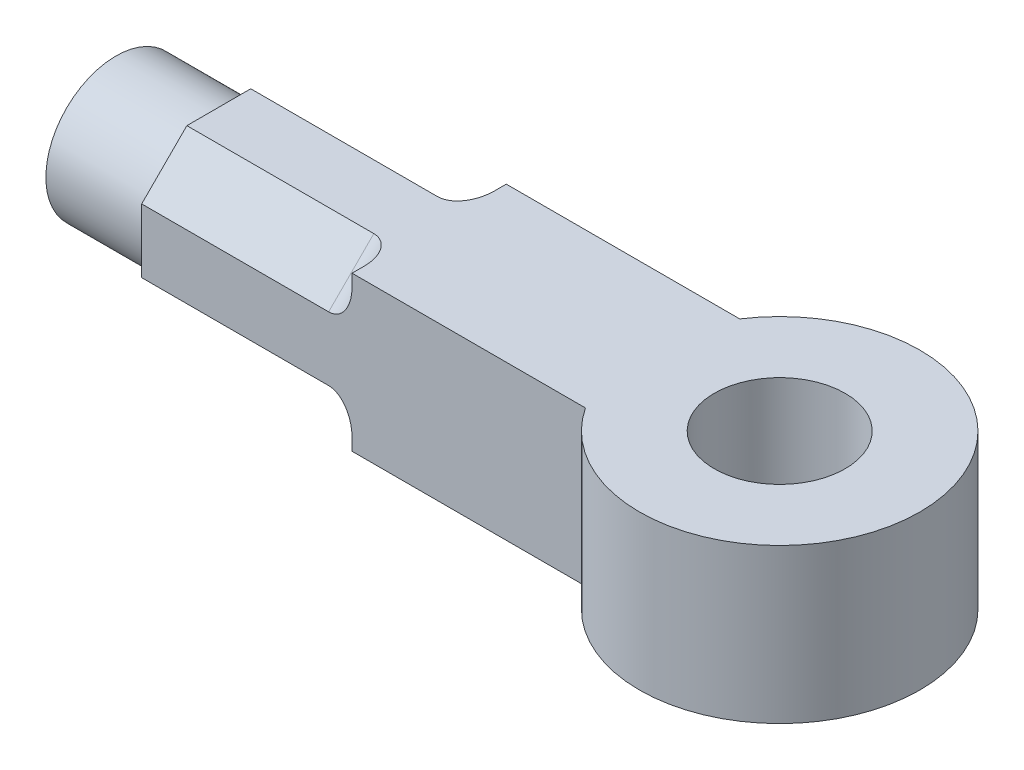
ISO-10303-21;
HEADER;
FILE_DESCRIPTION(('STEP AP214'),'2;1');
FILE_NAME('part.step','',(''),(''),'','','');
FILE_SCHEMA(('AUTOMOTIVE_DESIGN { 1 0 10303 214 1 1 1 1 }'));
ENDSEC;
DATA;
#1=APPLICATION_CONTEXT('core data for automotive mechanical design processes');
#2=APPLICATION_PROTOCOL_DEFINITION('international standard','automotive_design',2000,#1);
#3=PRODUCT_CONTEXT('',#1,'mechanical');
#4=PRODUCT('Part','Part','',(#3));
#5=PRODUCT_RELATED_PRODUCT_CATEGORY('part','',(#4));
#6=PRODUCT_DEFINITION_FORMATION('','',#4);
#7=PRODUCT_DEFINITION_CONTEXT('part definition',#1,'design');
#8=PRODUCT_DEFINITION('design','',#6,#7);
#9=PRODUCT_DEFINITION_SHAPE('','',#8);
#10=(LENGTH_UNIT() NAMED_UNIT(*) SI_UNIT(.MILLI.,.METRE.));
#11=(NAMED_UNIT(*) PLANE_ANGLE_UNIT() SI_UNIT($,.RADIAN.));
#12=(NAMED_UNIT(*) SI_UNIT($,.STERADIAN.) SOLID_ANGLE_UNIT());
#13=UNCERTAINTY_MEASURE_WITH_UNIT(LENGTH_MEASURE(1.E-05),#10,'distance_accuracy_value','');
#14=(GEOMETRIC_REPRESENTATION_CONTEXT(3) GLOBAL_UNCERTAINTY_ASSIGNED_CONTEXT((#13)) GLOBAL_UNIT_ASSIGNED_CONTEXT((#10,
#11,#12)) REPRESENTATION_CONTEXT('',''));
#15=CARTESIAN_POINT('',(0.,0.,0.));
#16=DIRECTION('',(0.,0.,1.));
#17=DIRECTION('',(1.,0.,0.));
#18=AXIS2_PLACEMENT_3D('',#15,#16,#17);
#19=CARTESIAN_POINT('',(-49.1176439316651,0.,0.));
#20=DIRECTION('',(-1.,0.,0.));
#21=DIRECTION('',(0.,0.,1.));
#22=AXIS2_PLACEMENT_3D('',#19,#20,#21);
#23=PLANE('',#22);
#24=DIRECTION('',(0.,0.,1.));
#25=VECTOR('',#24,1.);
#26=CARTESIAN_POINT('',(-49.1176439316651,1.65,-1.65));
#27=LINE('',#26,#25);
#28=CARTESIAN_POINT('',(-49.1176439316651,1.65,1.39055915910216));
#29=VERTEX_POINT('',#28);
#30=CARTESIAN_POINT('',(-49.1176439316651,1.65,1.65));
#31=VERTEX_POINT('',#30);
#32=EDGE_CURVE('E252',#29,#31,#27,.T.);
#33=ORIENTED_EDGE('',*,*,#32,.F.);
#34=DIRECTION('',(0.,-0.707106781186548,0.707106781186547));
#35=VECTOR('',#34,1.);
#36=CARTESIAN_POINT('',(-49.1176439316651,1.52027957955108,1.52027957955108));
#37=LINE('',#36,#35);
#38=CARTESIAN_POINT('',(-49.1176439316651,1.39055915910216,1.65));
#39=VERTEX_POINT('',#38);
#40=EDGE_CURVE('E202',#29,#39,#37,.T.);
#41=ORIENTED_EDGE('',*,*,#40,.T.);
#42=DIRECTION('',(0.,-1.,0.));
#43=VECTOR('',#42,1.);
#44=CARTESIAN_POINT('',(-49.1176439316651,1.65,1.65));
#45=LINE('',#44,#43);
#46=EDGE_CURVE('E192',#31,#39,#45,.T.);
#47=ORIENTED_EDGE('',*,*,#46,.F.);
#48=EDGE_LOOP('',(#33,#41,#47));
#49=FACE_BOUND('',#48,.T.);
#50=ADVANCED_FACE('F38',(#49),#23,.T.);
#51=CARTESIAN_POINT('',(-49.1176439316651,-1.39055915910215,1.65));
#52=VERTEX_POINT('',#51);
#53=CARTESIAN_POINT('',(-49.1176439316651,-1.65,1.65));
#54=VERTEX_POINT('',#53);
#55=EDGE_CURVE('E156',#52,#54,#45,.T.);
#56=ORIENTED_EDGE('',*,*,#55,.F.);
#57=DIRECTION('',(0.,-0.707106781186548,-0.707106781186548));
#58=VECTOR('',#57,1.);
#59=CARTESIAN_POINT('',(-49.1176439316651,-1.52027957955108,1.52027957955108));
#60=LINE('',#59,#58);
#61=CARTESIAN_POINT('',(-49.1176439316651,-1.65,1.39055915910215));
#62=VERTEX_POINT('',#61);
#63=EDGE_CURVE('E187',#52,#62,#60,.T.);
#64=ORIENTED_EDGE('',*,*,#63,.T.);
#65=DIRECTION('',(0.,0.,-1.));
#66=VECTOR('',#65,1.);
#67=CARTESIAN_POINT('',(-49.1176439316651,-1.65,-1.65));
#68=LINE('',#67,#66);
#69=EDGE_CURVE('E238',#54,#62,#68,.T.);
#70=ORIENTED_EDGE('',*,*,#69,.F.);
#71=EDGE_LOOP('',(#56,#64,#70));
#72=FACE_BOUND('',#71,.T.);
#73=ADVANCED_FACE('F355',(#72),#23,.T.);
#74=CARTESIAN_POINT('',(-49.1176439316651,-1.65,-1.39055915910215));
#75=VERTEX_POINT('',#74);
#76=CARTESIAN_POINT('',(-49.1176439316651,-1.65,-1.65));
#77=VERTEX_POINT('',#76);
#78=EDGE_CURVE('E240',#75,#77,#68,.T.);
#79=ORIENTED_EDGE('',*,*,#78,.F.);
#80=DIRECTION('',(0.,0.707106781186547,-0.707106781186548));
#81=VECTOR('',#80,1.);
#82=CARTESIAN_POINT('',(-49.1176439316651,-1.52027957955108,-1.52027957955108));
#83=LINE('',#82,#81);
#84=CARTESIAN_POINT('',(-49.1176439316651,-1.39055915910215,-1.65));
#85=VERTEX_POINT('',#84);
#86=EDGE_CURVE('E195',#75,#85,#83,.T.);
#87=ORIENTED_EDGE('',*,*,#86,.T.);
#88=DIRECTION('',(0.,1.,0.));
#89=VECTOR('',#88,1.);
#90=CARTESIAN_POINT('',(-49.1176439316651,1.65,-1.65));
#91=LINE('',#90,#89);
#92=EDGE_CURVE('E243',#77,#85,#91,.T.);
#93=ORIENTED_EDGE('',*,*,#92,.F.);
#94=EDGE_LOOP('',(#79,#87,#93));
#95=FACE_BOUND('',#94,.T.);
#96=ADVANCED_FACE('F362',(#95),#23,.T.);
#97=CARTESIAN_POINT('',(-49.1176439316651,1.39055915910216,-1.65));
#98=VERTEX_POINT('',#97);
#99=CARTESIAN_POINT('',(-49.1176439316651,1.65,-1.65));
#100=VERTEX_POINT('',#99);
#101=EDGE_CURVE('E246',#98,#100,#91,.T.);
#102=ORIENTED_EDGE('',*,*,#101,.F.);
#103=DIRECTION('',(0.,0.707106781186548,0.707106781186548));
#104=VECTOR('',#103,1.);
#105=CARTESIAN_POINT('',(-49.1176439316651,1.52027957955108,-1.52027957955108));
#106=LINE('',#105,#104);
#107=CARTESIAN_POINT('',(-49.1176439316651,1.65,-1.39055915910215));
#108=VERTEX_POINT('',#107);
#109=EDGE_CURVE('E209',#98,#108,#106,.T.);
#110=ORIENTED_EDGE('',*,*,#109,.T.);
#111=EDGE_CURVE('E250',#100,#108,#27,.T.);
#112=ORIENTED_EDGE('',*,*,#111,.F.);
#113=EDGE_LOOP('',(#102,#110,#112));
#114=FACE_BOUND('',#113,.T.);
#115=ADVANCED_FACE('F358',(#114),#23,.T.);
#116=CARTESIAN_POINT('',(-41.6176439316651,1.8,0.));
#117=DIRECTION('',(0.,-1.,0.));
#118=DIRECTION('',(0.,0.,-1.));
#119=AXIS2_PLACEMENT_3D('',#116,#117,#118);
#120=CYLINDRICAL_SURFACE('',#119,3.);
#121=DIRECTION('',(0.,-1.,0.));
#122=VECTOR('',#121,1.);
#123=CARTESIAN_POINT('',(-44.1231378949386,1.8,1.65));
#124=LINE('',#123,#122);
#125=CARTESIAN_POINT('',(-44.1231378949386,1.65,1.65));
#126=VERTEX_POINT('',#125);
#127=CARTESIAN_POINT('',(-44.1231378949354,-1.65,1.65));
#128=VERTEX_POINT('',#127);
#129=EDGE_CURVE('E154',#126,#128,#124,.T.);
#130=ORIENTED_EDGE('',*,*,#129,.T.);
#131=CARTESIAN_POINT('',(-41.6176439316651,-1.65,0.));
#132=DIRECTION('',(0.,1.,0.));
#133=DIRECTION('',(0.,0.,1.));
#134=AXIS2_PLACEMENT_3D('',#131,#132,#133);
#135=CIRCLE('',#134,3.);
#136=CARTESIAN_POINT('',(-44.1231378949386,-1.65,-1.65));
#137=VERTEX_POINT('',#136);
#138=EDGE_CURVE('E164',#128,#137,#135,.T.);
#139=ORIENTED_EDGE('',*,*,#138,.T.);
#140=DIRECTION('',(0.,-1.,0.));
#141=VECTOR('',#140,1.);
#142=CARTESIAN_POINT('',(-44.1231378949386,1.8,-1.65));
#143=LINE('',#142,#141);
#144=CARTESIAN_POINT('',(-44.1231378949354,1.65,-1.65));
#145=VERTEX_POINT('',#144);
#146=EDGE_CURVE('E178',#137,#145,#143,.F.);
#147=ORIENTED_EDGE('',*,*,#146,.T.);
#148=CARTESIAN_POINT('',(-41.6176439316651,1.65,0.));
#149=DIRECTION('',(0.,-1.,0.));
#150=DIRECTION('',(0.,0.,-1.));
#151=AXIS2_PLACEMENT_3D('',#148,#149,#150);
#152=CIRCLE('',#151,3.);
#153=EDGE_CURVE('E176',#145,#126,#152,.T.);
#154=ORIENTED_EDGE('',*,*,#153,.T.);
#155=EDGE_LOOP('',(#130,#139,#147,#154));
#156=FACE_BOUND('',#155,.T.);
#157=ADVANCED_FACE('F174',(#156),#120,.T.);
#158=CARTESIAN_POINT('',(-41.6176439316651,1.8,0.));
#159=DIRECTION('',(0.,-1.,0.));
#160=DIRECTION('',(0.,0.,-1.));
#161=AXIS2_PLACEMENT_3D('',#158,#159,#160);
#162=CYLINDRICAL_SURFACE('',#161,1.4);
#163=CARTESIAN_POINT('',(-41.6176439316651,-1.65,0.));
#164=DIRECTION('',(0.,1.,0.));
#165=DIRECTION('',(0.,0.,1.));
#166=AXIS2_PLACEMENT_3D('',#163,#164,#165);
#167=CIRCLE('',#166,1.4);
#168=CARTESIAN_POINT('',(-41.6176439316651,-1.65,1.4));
#169=VERTEX_POINT('',#168);
#170=EDGE_CURVE('E171',#169,#169,#167,.T.);
#171=ORIENTED_EDGE('',*,*,#170,.F.);
#172=EDGE_LOOP('',(#171));
#173=FACE_BOUND('',#172,.T.);
#174=CARTESIAN_POINT('',(-41.6176439316651,1.65,0.));
#175=DIRECTION('',(0.,-1.,0.));
#176=DIRECTION('',(0.,0.,-1.));
#177=AXIS2_PLACEMENT_3D('',#174,#175,#176);
#178=CIRCLE('',#177,1.4);
#179=CARTESIAN_POINT('',(-41.6176439316651,1.65,-1.4));
#180=VERTEX_POINT('',#179);
#181=EDGE_CURVE('E322',#180,#180,#178,.T.);
#182=ORIENTED_EDGE('',*,*,#181,.F.);
#183=EDGE_LOOP('',(#182));
#184=FACE_BOUND('',#183,.T.);
#185=ADVANCED_FACE('F335',(#173,#184),#162,.F.);
#186=CARTESIAN_POINT('',(49958.3823560683,-1.65,-1.65));
#187=DIRECTION('',(0.,1.,0.));
#188=DIRECTION('',(0.,0.,1.));
#189=AXIS2_PLACEMENT_3D('',#186,#187,#188);
#190=PLANE('',#189);
#191=ORIENTED_EDGE('',*,*,#78,.T.);
#192=DIRECTION('',(-1.,0.,0.));
#193=VECTOR('',#192,1.);
#194=CARTESIAN_POINT('',(49958.3823560683,-1.65,-1.65));
#195=LINE('',#194,#193);
#196=EDGE_CURVE('E161',#137,#77,#195,.T.);
#197=ORIENTED_EDGE('',*,*,#196,.F.);
#198=ORIENTED_EDGE('',*,*,#138,.F.);
#199=DIRECTION('',(-1.,0.,0.));
#200=VECTOR('',#199,1.);
#201=CARTESIAN_POINT('',(49958.3823560683,-1.65,1.65));
#202=LINE('',#201,#200);
#203=EDGE_CURVE('E150',#128,#54,#202,.T.);
#204=ORIENTED_EDGE('',*,*,#203,.T.);
#205=ORIENTED_EDGE('',*,*,#69,.T.);
#206=CARTESIAN_POINT('',(-49.6176439316651,-1.65,1.39055915910215));
#207=DIRECTION('',(0.,1.,0.));
#208=DIRECTION('',(0.,0.,-1.));
#209=AXIS2_PLACEMENT_3D('',#206,#207,#208);
#210=ELLIPSE('',#209,0.707106781186547,0.5);
#211=CARTESIAN_POINT('',(-49.6176439316651,-1.65,0.683452377915608));
#212=VERTEX_POINT('',#211);
#213=EDGE_CURVE('E215',#62,#212,#210,.T.);
#214=ORIENTED_EDGE('',*,*,#213,.T.);
#215=DIRECTION('',(-1.,0.,0.));
#216=VECTOR('',#215,1.);
#217=CARTESIAN_POINT('',(-49.1176439316651,-1.65,0.683452377915608));
#218=LINE('',#217,#216);
#219=CARTESIAN_POINT('',(-53.6176439316651,-1.65,0.683452377915608));
#220=VERTEX_POINT('',#219);
#221=EDGE_CURVE('E267',#212,#220,#218,.T.);
#222=ORIENTED_EDGE('',*,*,#221,.T.);
#223=DIRECTION('',(0.,0.,-1.));
#224=VECTOR('',#223,1.);
#225=CARTESIAN_POINT('',(-53.6176439316651,-1.65,0.683452377915608));
#226=LINE('',#225,#224);
#227=CARTESIAN_POINT('',(-53.6176439316651,-1.65,-0.683452377915607));
#228=VERTEX_POINT('',#227);
#229=EDGE_CURVE('E301',#220,#228,#226,.T.);
#230=ORIENTED_EDGE('',*,*,#229,.T.);
#231=DIRECTION('',(-1.,0.,0.));
#232=VECTOR('',#231,1.);
#233=CARTESIAN_POINT('',(-49.1176439316651,-1.65,-0.683452377915607));
#234=LINE('',#233,#232);
#235=CARTESIAN_POINT('',(-49.6176439316651,-1.65,-0.683452377915607));
#236=VERTEX_POINT('',#235);
#237=EDGE_CURVE('E270',#236,#228,#234,.T.);
#238=ORIENTED_EDGE('',*,*,#237,.F.);
#239=CARTESIAN_POINT('',(-49.6176439316651,-1.65,-1.39055915910215));
#240=DIRECTION('',(0.,1.,0.));
#241=DIRECTION('',(0.,0.,-1.));
#242=AXIS2_PLACEMENT_3D('',#239,#240,#241);
#243=ELLIPSE('',#242,0.707106781186548,0.5);
#244=EDGE_CURVE('E224',#236,#75,#243,.T.);
#245=ORIENTED_EDGE('',*,*,#244,.T.);
#246=EDGE_LOOP('',(#191,#197,#198,#204,#205,#214,#222,#230,#238,#245));
#247=FACE_BOUND('',#246,.T.);
#248=ORIENTED_EDGE('',*,*,#170,.T.);
#249=EDGE_LOOP('',(#248));
#250=FACE_BOUND('',#249,.T.);
#251=ADVANCED_FACE('F166',(#247,#250),#190,.F.);
#252=CARTESIAN_POINT('',(49958.3823560683,1.65,1.65));
#253=DIRECTION('',(0.,0.,-1.));
#254=DIRECTION('',(0.,1.,0.));
#255=AXIS2_PLACEMENT_3D('',#252,#253,#254);
#256=PLANE('',#255);
#257=ORIENTED_EDGE('',*,*,#203,.F.);
#258=ORIENTED_EDGE('',*,*,#129,.F.);
#259=DIRECTION('',(-1.,0.,0.));
#260=VECTOR('',#259,1.);
#261=CARTESIAN_POINT('',(49958.3823560683,1.65,1.65));
#262=LINE('',#261,#260);
#263=EDGE_CURVE('E184',#126,#31,#262,.T.);
#264=ORIENTED_EDGE('',*,*,#263,.T.);
#265=ORIENTED_EDGE('',*,*,#46,.T.);
#266=CARTESIAN_POINT('',(-49.6176439316651,1.39055915910216,1.65));
#267=DIRECTION('',(0.,0.,-1.));
#268=DIRECTION('',(0.,-1.,0.));
#269=AXIS2_PLACEMENT_3D('',#266,#267,#268);
#270=ELLIPSE('',#269,0.707106781186547,0.5);
#271=CARTESIAN_POINT('',(-49.6176439316651,0.683452377915608,1.65));
#272=VERTEX_POINT('',#271);
#273=EDGE_CURVE('E227',#39,#272,#270,.T.);
#274=ORIENTED_EDGE('',*,*,#273,.T.);
#275=DIRECTION('',(-1.,0.,0.));
#276=VECTOR('',#275,1.);
#277=CARTESIAN_POINT('',(-49.1176439316651,0.683452377915608,1.65));
#278=LINE('',#277,#276);
#279=CARTESIAN_POINT('',(-53.6176439316651,0.683452377915608,1.65));
#280=VERTEX_POINT('',#279);
#281=EDGE_CURVE('E181',#272,#280,#278,.T.);
#282=ORIENTED_EDGE('',*,*,#281,.T.);
#283=DIRECTION('',(0.,-1.,0.));
#284=VECTOR('',#283,1.);
#285=CARTESIAN_POINT('',(-53.6176439316651,0.683452377915608,1.65));
#286=LINE('',#285,#284);
#287=CARTESIAN_POINT('',(-53.6176439316651,-0.683452377915606,1.65));
#288=VERTEX_POINT('',#287);
#289=EDGE_CURVE('E309',#280,#288,#286,.T.);
#290=ORIENTED_EDGE('',*,*,#289,.T.);
#291=DIRECTION('',(-1.,0.,0.));
#292=VECTOR('',#291,1.);
#293=CARTESIAN_POINT('',(-49.1176439316651,-0.683452377915606,1.65));
#294=LINE('',#293,#292);
#295=CARTESIAN_POINT('',(-49.6176439316651,-0.683452377915606,1.65));
#296=VERTEX_POINT('',#295);
#297=EDGE_CURVE('E264',#296,#288,#294,.T.);
#298=ORIENTED_EDGE('',*,*,#297,.F.);
#299=CARTESIAN_POINT('',(-49.6176439316651,-1.39055915910215,1.65));
#300=DIRECTION('',(0.,0.,-1.));
#301=DIRECTION('',(0.,-1.,0.));
#302=AXIS2_PLACEMENT_3D('',#299,#300,#301);
#303=ELLIPSE('',#302,0.707106781186548,0.5);
#304=EDGE_CURVE('E218',#296,#52,#303,.T.);
#305=ORIENTED_EDGE('',*,*,#304,.T.);
#306=ORIENTED_EDGE('',*,*,#55,.T.);
#307=EDGE_LOOP('',(#257,#258,#264,#265,#274,#282,#290,#298,#305,#306));
#308=FACE_BOUND('',#307,.T.);
#309=ADVANCED_FACE('F152',(#308),#256,.F.);
#310=CARTESIAN_POINT('',(49958.3823560683,1.65,-1.65));
#311=DIRECTION('',(0.,0.,1.));
#312=DIRECTION('',(0.,-1.,0.));
#313=AXIS2_PLACEMENT_3D('',#310,#311,#312);
#314=PLANE('',#313);
#315=ORIENTED_EDGE('',*,*,#146,.F.);
#316=ORIENTED_EDGE('',*,*,#196,.T.);
#317=ORIENTED_EDGE('',*,*,#92,.T.);
#318=CARTESIAN_POINT('',(-49.6176439316651,-1.39055915910215,-1.65));
#319=DIRECTION('',(0.,0.,1.));
#320=DIRECTION('',(0.,1.,0.));
#321=AXIS2_PLACEMENT_3D('',#318,#319,#320);
#322=ELLIPSE('',#321,0.707106781186547,0.5);
#323=CARTESIAN_POINT('',(-49.6176439316651,-0.683452377915606,-1.65));
#324=VERTEX_POINT('',#323);
#325=EDGE_CURVE('E221',#85,#324,#322,.T.);
#326=ORIENTED_EDGE('',*,*,#325,.T.);
#327=DIRECTION('',(-1.,0.,0.));
#328=VECTOR('',#327,1.);
#329=CARTESIAN_POINT('',(-49.1176439316651,-0.683452377915606,-1.65));
#330=LINE('',#329,#328);
#331=CARTESIAN_POINT('',(-53.6176439316651,-0.683452377915606,-1.65));
#332=VERTEX_POINT('',#331);
#333=EDGE_CURVE('E273',#324,#332,#330,.T.);
#334=ORIENTED_EDGE('',*,*,#333,.T.);
#335=DIRECTION('',(0.,1.,0.));
#336=VECTOR('',#335,1.);
#337=CARTESIAN_POINT('',(-53.6176439316651,-0.683452377915606,-1.65));
#338=LINE('',#337,#336);
#339=CARTESIAN_POINT('',(-53.6176439316651,0.683452377915607,-1.65));
#340=VERTEX_POINT('',#339);
#341=EDGE_CURVE('E293',#332,#340,#338,.T.);
#342=ORIENTED_EDGE('',*,*,#341,.T.);
#343=DIRECTION('',(-1.,0.,0.));
#344=VECTOR('',#343,1.);
#345=CARTESIAN_POINT('',(-49.1176439316651,0.683452377915607,-1.65));
#346=LINE('',#345,#344);
#347=CARTESIAN_POINT('',(-49.6176439316651,0.683452377915607,-1.65));
#348=VERTEX_POINT('',#347);
#349=EDGE_CURVE('E276',#348,#340,#346,.T.);
#350=ORIENTED_EDGE('',*,*,#349,.F.);
#351=CARTESIAN_POINT('',(-49.6176439316651,1.39055915910216,-1.65));
#352=DIRECTION('',(0.,0.,1.));
#353=DIRECTION('',(0.,1.,0.));
#354=AXIS2_PLACEMENT_3D('',#351,#352,#353);
#355=ELLIPSE('',#354,0.707106781186548,0.5);
#356=EDGE_CURVE('E11',#348,#98,#355,.T.);
#357=ORIENTED_EDGE('',*,*,#356,.T.);
#358=ORIENTED_EDGE('',*,*,#101,.T.);
#359=DIRECTION('',(-1.,0.,0.));
#360=VECTOR('',#359,1.);
#361=CARTESIAN_POINT('',(49958.3823560683,1.65,-1.65));
#362=LINE('',#361,#360);
#363=EDGE_CURVE('E257',#145,#100,#362,.T.);
#364=ORIENTED_EDGE('',*,*,#363,.F.);
#365=EDGE_LOOP('',(#315,#316,#317,#326,#334,#342,#350,#357,#358,#364));
#366=FACE_BOUND('',#365,.T.);
#367=ADVANCED_FACE('F344',(#366),#314,.F.);
#368=CARTESIAN_POINT('',(49958.3823560683,1.65,-1.65));
#369=DIRECTION('',(0.,-1.,0.));
#370=DIRECTION('',(0.,0.,-1.));
#371=AXIS2_PLACEMENT_3D('',#368,#369,#370);
#372=PLANE('',#371);
#373=ORIENTED_EDGE('',*,*,#32,.T.);
#374=ORIENTED_EDGE('',*,*,#263,.F.);
#375=ORIENTED_EDGE('',*,*,#153,.F.);
#376=ORIENTED_EDGE('',*,*,#363,.T.);
#377=ORIENTED_EDGE('',*,*,#111,.T.);
#378=CARTESIAN_POINT('',(-49.6176439316651,1.65,-1.39055915910215));
#379=DIRECTION('',(0.,-1.,0.));
#380=DIRECTION('',(0.,0.,1.));
#381=AXIS2_PLACEMENT_3D('',#378,#379,#380);
#382=ELLIPSE('',#381,0.707106781186547,0.5);
#383=CARTESIAN_POINT('',(-49.6176439316651,1.65,-0.683452377915606));
#384=VERTEX_POINT('',#383);
#385=EDGE_CURVE('E47',#108,#384,#382,.T.);
#386=ORIENTED_EDGE('',*,*,#385,.T.);
#387=DIRECTION('',(-1.,0.,0.));
#388=VECTOR('',#387,1.);
#389=CARTESIAN_POINT('',(-49.1176439316651,1.65,-0.683452377915606));
#390=LINE('',#389,#388);
#391=CARTESIAN_POINT('',(-53.6176439316651,1.65,-0.683452377915606));
#392=VERTEX_POINT('',#391);
#393=EDGE_CURVE('E279',#384,#392,#390,.T.);
#394=ORIENTED_EDGE('',*,*,#393,.T.);
#395=DIRECTION('',(0.,0.,1.));
#396=VECTOR('',#395,1.);
#397=CARTESIAN_POINT('',(-53.6176439316651,1.65,-0.683452377915606));
#398=LINE('',#397,#396);
#399=CARTESIAN_POINT('',(-53.6176439316651,1.65,0.683452377915608));
#400=VERTEX_POINT('',#399);
#401=EDGE_CURVE('E285',#392,#400,#398,.T.);
#402=ORIENTED_EDGE('',*,*,#401,.T.);
#403=DIRECTION('',(-1.,0.,0.));
#404=VECTOR('',#403,1.);
#405=CARTESIAN_POINT('',(-49.1176439316651,1.65,0.683452377915608));
#406=LINE('',#405,#404);
#407=CARTESIAN_POINT('',(-49.6176439316651,1.65,0.683452377915608));
#408=VERTEX_POINT('',#407);
#409=EDGE_CURVE('E282',#408,#400,#406,.T.);
#410=ORIENTED_EDGE('',*,*,#409,.F.);
#411=CARTESIAN_POINT('',(-49.6176439316651,1.65,1.39055915910216));
#412=DIRECTION('',(0.,-1.,0.));
#413=DIRECTION('',(0.,0.,1.));
#414=AXIS2_PLACEMENT_3D('',#411,#412,#413);
#415=ELLIPSE('',#414,0.707106781186547,0.5);
#416=EDGE_CURVE('E230',#408,#29,#415,.T.);
#417=ORIENTED_EDGE('',*,*,#416,.T.);
#418=EDGE_LOOP('',(#373,#374,#375,#376,#377,#386,#394,#402,#410,#417));
#419=FACE_BOUND('',#418,.T.);
#420=ORIENTED_EDGE('',*,*,#181,.T.);
#421=EDGE_LOOP('',(#420));
#422=FACE_BOUND('',#421,.T.);
#423=ADVANCED_FACE('F341',(#419,#422),#372,.F.);
#424=CARTESIAN_POINT('',(-49.1176439316651,1.65,0.683452377915608));
#425=DIRECTION('',(0.,-0.707106781186547,-0.707106781186548));
#426=DIRECTION('',(0.,0.707106781186548,-0.707106781186547));
#427=AXIS2_PLACEMENT_3D('',#424,#425,#426);
#428=PLANE('',#427);
#429=ORIENTED_EDGE('',*,*,#281,.F.);
#430=DIRECTION('',(0.,-0.707106781186548,0.707106781186547));
#431=VECTOR('',#430,1.);
#432=CARTESIAN_POINT('',(-49.6176439316651,1.65,0.683452377915608));
#433=LINE('',#432,#431);
#434=EDGE_CURVE('E206',#272,#408,#433,.F.);
#435=ORIENTED_EDGE('',*,*,#434,.T.);
#436=ORIENTED_EDGE('',*,*,#409,.T.);
#437=DIRECTION('',(0.,-0.707106781186547,0.707106781186547));
#438=VECTOR('',#437,1.);
#439=CARTESIAN_POINT('',(-53.6176439316651,1.65,0.683452377915608));
#440=LINE('',#439,#438);
#441=EDGE_CURVE('E313',#400,#280,#440,.T.);
#442=ORIENTED_EDGE('',*,*,#441,.T.);
#443=EDGE_LOOP('',(#429,#435,#436,#442));
#444=FACE_BOUND('',#443,.T.);
#445=ADVANCED_FACE('F343',(#444),#428,.F.);
#446=CARTESIAN_POINT('',(-49.1176439316651,-0.683452377915606,1.65));
#447=DIRECTION('',(0.,0.707106781186547,-0.707106781186547));
#448=DIRECTION('',(0.,0.707106781186548,0.707106781186548));
#449=AXIS2_PLACEMENT_3D('',#446,#447,#448);
#450=PLANE('',#449);
#451=ORIENTED_EDGE('',*,*,#221,.F.);
#452=DIRECTION('',(0.,-0.707106781186548,-0.707106781186548));
#453=VECTOR('',#452,1.);
#454=CARTESIAN_POINT('',(-49.6176439316651,-0.683452377915606,1.65));
#455=LINE('',#454,#453);
#456=EDGE_CURVE('E191',#212,#296,#455,.F.);
#457=ORIENTED_EDGE('',*,*,#456,.T.);
#458=ORIENTED_EDGE('',*,*,#297,.T.);
#459=DIRECTION('',(0.,-0.707106781186547,-0.707106781186547));
#460=VECTOR('',#459,1.);
#461=CARTESIAN_POINT('',(-53.6176439316651,-0.683452377915606,1.65));
#462=LINE('',#461,#460);
#463=EDGE_CURVE('E305',#288,#220,#462,.T.);
#464=ORIENTED_EDGE('',*,*,#463,.T.);
#465=EDGE_LOOP('',(#451,#457,#458,#464));
#466=FACE_BOUND('',#465,.T.);
#467=ADVANCED_FACE('F350',(#466),#450,.F.);
#468=CARTESIAN_POINT('',(-49.1176439316651,-1.65,-0.683452377915607));
#469=DIRECTION('',(0.,0.707106781186548,0.707106781186547));
#470=DIRECTION('',(0.,-0.707106781186547,0.707106781186548));
#471=AXIS2_PLACEMENT_3D('',#468,#469,#470);
#472=PLANE('',#471);
#473=ORIENTED_EDGE('',*,*,#333,.F.);
#474=DIRECTION('',(0.,0.707106781186547,-0.707106781186548));
#475=VECTOR('',#474,1.);
#476=CARTESIAN_POINT('',(-49.6176439316651,-1.65,-0.683452377915607));
#477=LINE('',#476,#475);
#478=EDGE_CURVE('E199',#324,#236,#477,.F.);
#479=ORIENTED_EDGE('',*,*,#478,.T.);
#480=ORIENTED_EDGE('',*,*,#237,.T.);
#481=DIRECTION('',(0.,0.707106781186547,-0.707106781186548));
#482=VECTOR('',#481,1.);
#483=CARTESIAN_POINT('',(-53.6176439316651,-1.65,-0.683452377915607));
#484=LINE('',#483,#482);
#485=EDGE_CURVE('E297',#228,#332,#484,.T.);
#486=ORIENTED_EDGE('',*,*,#485,.T.);
#487=EDGE_LOOP('',(#473,#479,#480,#486));
#488=FACE_BOUND('',#487,.T.);
#489=ADVANCED_FACE('F411',(#488),#472,.F.);
#490=CARTESIAN_POINT('',(-49.1176439316651,0.683452377915607,-1.65));
#491=DIRECTION('',(0.,-0.707106781186547,0.707106781186547));
#492=DIRECTION('',(0.,-0.707106781186548,-0.707106781186548));
#493=AXIS2_PLACEMENT_3D('',#490,#491,#492);
#494=PLANE('',#493);
#495=ORIENTED_EDGE('',*,*,#393,.F.);
#496=DIRECTION('',(0.,0.707106781186548,0.707106781186548));
#497=VECTOR('',#496,1.);
#498=CARTESIAN_POINT('',(-49.6176439316651,0.683452377915607,-1.65));
#499=LINE('',#498,#497);
#500=EDGE_CURVE('E54',#384,#348,#499,.F.);
#501=ORIENTED_EDGE('',*,*,#500,.T.);
#502=ORIENTED_EDGE('',*,*,#349,.T.);
#503=DIRECTION('',(0.,0.707106781186547,0.707106781186548));
#504=VECTOR('',#503,1.);
#505=CARTESIAN_POINT('',(-53.6176439316651,0.683452377915607,-1.65));
#506=LINE('',#505,#504);
#507=EDGE_CURVE('E289',#340,#392,#506,.T.);
#508=ORIENTED_EDGE('',*,*,#507,.T.);
#509=EDGE_LOOP('',(#495,#501,#502,#508));
#510=FACE_BOUND('',#509,.T.);
#511=ADVANCED_FACE('F382',(#510),#494,.F.);
#512=CARTESIAN_POINT('',(-53.6176439316651,0.,0.));
#513=DIRECTION('',(1.,0.,0.));
#514=DIRECTION('',(0.,0.,-1.));
#515=AXIS2_PLACEMENT_3D('',#512,#513,#514);
#516=PLANE('',#515);
#517=CARTESIAN_POINT('',(-53.6176439316651,0.,0.));
#518=DIRECTION('',(1.,0.,0.));
#519=DIRECTION('',(0.,0.,-1.));
#520=AXIS2_PLACEMENT_3D('',#517,#518,#519);
#521=CIRCLE('',#520,1.5);
#522=CARTESIAN_POINT('',(-53.6176439316651,0.,-1.5));
#523=VERTEX_POINT('',#522);
#524=EDGE_CURVE('E318',#523,#523,#521,.T.);
#525=ORIENTED_EDGE('',*,*,#524,.T.);
#526=EDGE_LOOP('',(#525));
#527=FACE_BOUND('',#526,.T.);
#528=ORIENTED_EDGE('',*,*,#441,.F.);
#529=ORIENTED_EDGE('',*,*,#401,.F.);
#530=ORIENTED_EDGE('',*,*,#507,.F.);
#531=ORIENTED_EDGE('',*,*,#341,.F.);
#532=ORIENTED_EDGE('',*,*,#485,.F.);
#533=ORIENTED_EDGE('',*,*,#229,.F.);
#534=ORIENTED_EDGE('',*,*,#463,.F.);
#535=ORIENTED_EDGE('',*,*,#289,.F.);
#536=EDGE_LOOP('',(#528,#529,#530,#531,#532,#533,#534,#535));
#537=FACE_BOUND('',#536,.T.);
#538=ADVANCED_FACE('F386',(#527,#537),#516,.F.);
#539=CARTESIAN_POINT('',(-55.8176439316651,0.,0.));
#540=DIRECTION('',(1.,0.,0.));
#541=DIRECTION('',(0.,0.,-1.));
#542=AXIS2_PLACEMENT_3D('',#539,#540,#541);
#543=CYLINDRICAL_SURFACE('',#542,1.5);
#544=CARTESIAN_POINT('',(-55.8176439316651,0.,0.));
#545=DIRECTION('',(1.,0.,0.));
#546=DIRECTION('',(0.,0.,-1.));
#547=AXIS2_PLACEMENT_3D('',#544,#545,#546);
#548=CIRCLE('',#547,1.5);
#549=CARTESIAN_POINT('',(-55.8176439316651,0.,-1.5));
#550=VERTEX_POINT('',#549);
#551=EDGE_CURVE('E317',#550,#550,#548,.T.);
#552=ORIENTED_EDGE('',*,*,#551,.T.);
#553=EDGE_LOOP('',(#552));
#554=FACE_BOUND('',#553,.T.);
#555=ORIENTED_EDGE('',*,*,#524,.F.);
#556=EDGE_LOOP('',(#555));
#557=FACE_BOUND('',#556,.T.);
#558=ADVANCED_FACE('F429',(#554,#557),#543,.T.);
#559=CARTESIAN_POINT('',(-55.8176439316651,0.,0.));
#560=DIRECTION('',(1.,0.,0.));
#561=DIRECTION('',(0.,0.,-1.));
#562=AXIS2_PLACEMENT_3D('',#559,#560,#561);
#563=PLANE('',#562);
#564=ORIENTED_EDGE('',*,*,#551,.F.);
#565=EDGE_LOOP('',(#564));
#566=FACE_BOUND('',#565,.T.);
#567=ADVANCED_FACE('F424',(#566),#563,.F.);
#568=CARTESIAN_POINT('',(-49.6176439316651,-1.52027957955108,1.52027957955108));
#569=DIRECTION('',(0.,-0.707106781186548,-0.707106781186548));
#570=DIRECTION('',(0.,0.707106781186548,-0.707106781186548));
#571=AXIS2_PLACEMENT_3D('',#568,#569,#570);
#572=CYLINDRICAL_SURFACE('',#571,0.5);
#573=ORIENTED_EDGE('',*,*,#304,.F.);
#574=ORIENTED_EDGE('',*,*,#456,.F.);
#575=ORIENTED_EDGE('',*,*,#213,.F.);
#576=ORIENTED_EDGE('',*,*,#63,.F.);
#577=EDGE_LOOP('',(#573,#574,#575,#576));
#578=FACE_BOUND('',#577,.T.);
#579=ADVANCED_FACE('F406',(#578),#572,.F.);
#580=CARTESIAN_POINT('',(-49.6176439316651,-1.52027957955108,-1.52027957955108));
#581=DIRECTION('',(0.,0.707106781186547,-0.707106781186548));
#582=DIRECTION('',(0.,0.707106781186548,0.707106781186547));
#583=AXIS2_PLACEMENT_3D('',#580,#581,#582);
#584=CYLINDRICAL_SURFACE('',#583,0.5);
#585=ORIENTED_EDGE('',*,*,#244,.F.);
#586=ORIENTED_EDGE('',*,*,#478,.F.);
#587=ORIENTED_EDGE('',*,*,#325,.F.);
#588=ORIENTED_EDGE('',*,*,#86,.F.);
#589=EDGE_LOOP('',(#585,#586,#587,#588));
#590=FACE_BOUND('',#589,.T.);
#591=ADVANCED_FACE('F414',(#590),#584,.F.);
#592=CARTESIAN_POINT('',(-49.6176439316651,1.52027957955108,1.52027957955108));
#593=DIRECTION('',(0.,-0.707106781186548,0.707106781186547));
#594=DIRECTION('',(0.,-0.707106781186547,-0.707106781186548));
#595=AXIS2_PLACEMENT_3D('',#592,#593,#594);
#596=CYLINDRICAL_SURFACE('',#595,0.5);
#597=ORIENTED_EDGE('',*,*,#416,.F.);
#598=ORIENTED_EDGE('',*,*,#434,.F.);
#599=ORIENTED_EDGE('',*,*,#273,.F.);
#600=ORIENTED_EDGE('',*,*,#40,.F.);
#601=EDGE_LOOP('',(#597,#598,#599,#600));
#602=FACE_BOUND('',#601,.T.);
#603=ADVANCED_FACE('F393',(#602),#596,.F.);
#604=CARTESIAN_POINT('',(-49.6176439316651,1.52027957955108,-1.52027957955108));
#605=DIRECTION('',(0.,0.707106781186548,0.707106781186548));
#606=DIRECTION('',(0.,-0.707106781186548,0.707106781186548));
#607=AXIS2_PLACEMENT_3D('',#604,#605,#606);
#608=CYLINDRICAL_SURFACE('',#607,0.5);
#609=ORIENTED_EDGE('',*,*,#356,.F.);
#610=ORIENTED_EDGE('',*,*,#500,.F.);
#611=ORIENTED_EDGE('',*,*,#385,.F.);
#612=ORIENTED_EDGE('',*,*,#109,.F.);
#613=EDGE_LOOP('',(#609,#610,#611,#612));
#614=FACE_BOUND('',#613,.T.);
#615=ADVANCED_FACE('F40',(#614),#608,.F.);
#616=CLOSED_SHELL('',(#50,#73,#96,#115,#157,#185,#251,#309,#367,#423,#445,#467,#489,#511,#538,
#558,#567,#579,#591,#603,#615));
#617=MANIFOLD_SOLID_BREP('B2',#616);
#618=ADVANCED_BREP_SHAPE_REPRESENTATION('',(#18,#617),#14);
#619=SHAPE_DEFINITION_REPRESENTATION(#9,#618);
ENDSEC;
END-ISO-10303-21;
